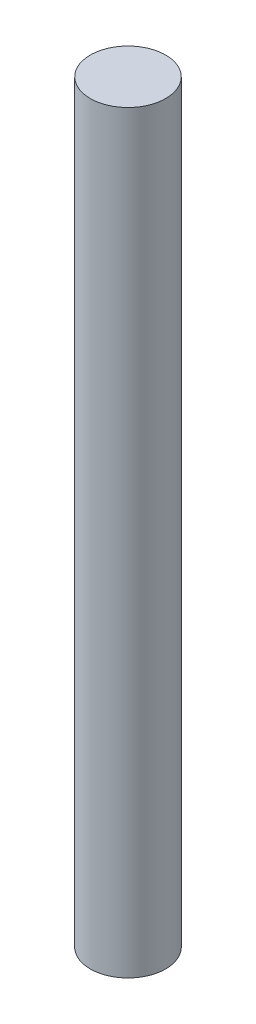
ISO-10303-21;
HEADER;
FILE_DESCRIPTION(('STEP AP214'),'2;1');
FILE_NAME('part.step','',(''),(''),'','','');
FILE_SCHEMA(('AUTOMOTIVE_DESIGN { 1 0 10303 214 1 1 1 1 }'));
ENDSEC;
DATA;
#1=APPLICATION_CONTEXT('core data for automotive mechanical design processes');
#2=APPLICATION_PROTOCOL_DEFINITION('international standard','automotive_design',2000,#1);
#3=PRODUCT_CONTEXT('',#1,'mechanical');
#4=PRODUCT('Part','Part','',(#3));
#5=PRODUCT_RELATED_PRODUCT_CATEGORY('part','',(#4));
#6=PRODUCT_DEFINITION_FORMATION('','',#4);
#7=PRODUCT_DEFINITION_CONTEXT('part definition',#1,'design');
#8=PRODUCT_DEFINITION('design','',#6,#7);
#9=PRODUCT_DEFINITION_SHAPE('','',#8);
#10=(LENGTH_UNIT() NAMED_UNIT(*) SI_UNIT(.MILLI.,.METRE.));
#11=(NAMED_UNIT(*) PLANE_ANGLE_UNIT() SI_UNIT($,.RADIAN.));
#12=(NAMED_UNIT(*) SI_UNIT($,.STERADIAN.) SOLID_ANGLE_UNIT());
#13=UNCERTAINTY_MEASURE_WITH_UNIT(LENGTH_MEASURE(1.E-05),#10,'distance_accuracy_value','');
#14=(GEOMETRIC_REPRESENTATION_CONTEXT(3) GLOBAL_UNCERTAINTY_ASSIGNED_CONTEXT((#13)) GLOBAL_UNIT_ASSIGNED_CONTEXT((#10,
#11,#12)) REPRESENTATION_CONTEXT('',''));
#15=CARTESIAN_POINT('',(0.,0.,0.));
#16=DIRECTION('',(0.,0.,1.));
#17=DIRECTION('',(1.,0.,0.));
#18=AXIS2_PLACEMENT_3D('',#15,#16,#17);
#19=CARTESIAN_POINT('',(0.,225.,0.));
#20=DIRECTION('',(0.,-1.,0.));
#21=DIRECTION('',(0.,0.,-1.));
#22=AXIS2_PLACEMENT_3D('',#19,#20,#21);
#23=CYLINDRICAL_SURFACE('',#22,2.5);
#24=CARTESIAN_POINT('',(0.,225.,0.));
#25=DIRECTION('',(0.,1.,0.));
#26=DIRECTION('',(0.,0.,1.));
#27=AXIS2_PLACEMENT_3D('',#24,#25,#26);
#28=CIRCLE('',#27,2.5);
#29=CARTESIAN_POINT('',(0.,225.,2.5));
#30=VERTEX_POINT('',#29);
#31=EDGE_CURVE('E10',#30,#30,#28,.T.);
#32=ORIENTED_EDGE('',*,*,#31,.F.);
#33=EDGE_LOOP('',(#32));
#34=FACE_BOUND('',#33,.T.);
#35=CARTESIAN_POINT('',(0.,175.,0.));
#36=DIRECTION('',(0.,1.,0.));
#37=DIRECTION('',(0.,0.,1.));
#38=AXIS2_PLACEMENT_3D('',#35,#36,#37);
#39=CIRCLE('',#38,2.5);
#40=CARTESIAN_POINT('',(0.,175.,2.5));
#41=VERTEX_POINT('',#40);
#42=EDGE_CURVE('E37',#41,#41,#39,.T.);
#43=ORIENTED_EDGE('',*,*,#42,.T.);
#44=EDGE_LOOP('',(#43));
#45=FACE_BOUND('',#44,.T.);
#46=ADVANCED_FACE('F34',(#34,#45),#23,.T.);
#47=CARTESIAN_POINT('',(0.,225.,0.));
#48=DIRECTION('',(0.,1.,0.));
#49=DIRECTION('',(0.,0.,1.));
#50=AXIS2_PLACEMENT_3D('',#47,#48,#49);
#51=PLANE('',#50);
#52=ORIENTED_EDGE('',*,*,#31,.T.);
#53=EDGE_LOOP('',(#52));
#54=FACE_BOUND('',#53,.T.);
#55=ADVANCED_FACE('F49',(#54),#51,.T.);
#56=CARTESIAN_POINT('',(0.,175.,0.));
#57=DIRECTION('',(0.,1.,0.));
#58=DIRECTION('',(0.,0.,1.));
#59=AXIS2_PLACEMENT_3D('',#56,#57,#58);
#60=PLANE('',#59);
#61=ORIENTED_EDGE('',*,*,#42,.F.);
#62=EDGE_LOOP('',(#61));
#63=FACE_BOUND('',#62,.T.);
#64=ADVANCED_FACE('F47',(#63),#60,.F.);
#65=CLOSED_SHELL('',(#46,#55,#64));
#66=MANIFOLD_SOLID_BREP('B2',#65);
#67=ADVANCED_BREP_SHAPE_REPRESENTATION('',(#18,#66),#14);
#68=SHAPE_DEFINITION_REPRESENTATION(#9,#67);
ENDSEC;
END-ISO-10303-21;
